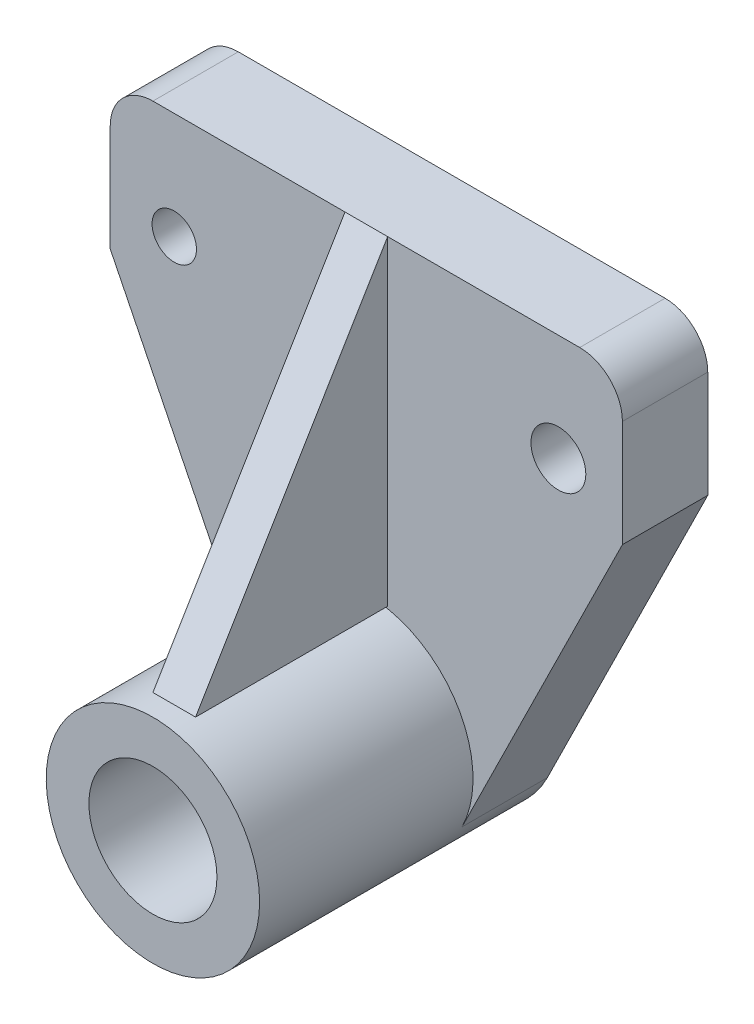
ISO-10303-21;
HEADER;
FILE_DESCRIPTION(('STEP AP214'),'2;1');
FILE_NAME('part.step','',(''),(''),'','','');
FILE_SCHEMA(('AUTOMOTIVE_DESIGN { 1 0 10303 214 1 1 1 1 }'));
ENDSEC;
DATA;
#1=APPLICATION_CONTEXT('core data for automotive mechanical design processes');
#2=APPLICATION_PROTOCOL_DEFINITION('international standard','automotive_design',2000,#1);
#3=PRODUCT_CONTEXT('',#1,'mechanical');
#4=PRODUCT('Part','Part','',(#3));
#5=PRODUCT_RELATED_PRODUCT_CATEGORY('part','',(#4));
#6=PRODUCT_DEFINITION_FORMATION('','',#4);
#7=PRODUCT_DEFINITION_CONTEXT('part definition',#1,'design');
#8=PRODUCT_DEFINITION('design','',#6,#7);
#9=PRODUCT_DEFINITION_SHAPE('','',#8);
#10=(LENGTH_UNIT() NAMED_UNIT(*) SI_UNIT(.MILLI.,.METRE.));
#11=(NAMED_UNIT(*) PLANE_ANGLE_UNIT() SI_UNIT($,.RADIAN.));
#12=(NAMED_UNIT(*) SI_UNIT($,.STERADIAN.) SOLID_ANGLE_UNIT());
#13=UNCERTAINTY_MEASURE_WITH_UNIT(LENGTH_MEASURE(1.E-05),#10,'distance_accuracy_value','');
#14=(GEOMETRIC_REPRESENTATION_CONTEXT(3) GLOBAL_UNCERTAINTY_ASSIGNED_CONTEXT((#13)) GLOBAL_UNIT_ASSIGNED_CONTEXT((#10,
#11,#12)) REPRESENTATION_CONTEXT('',''));
#15=CARTESIAN_POINT('',(0.,0.,0.));
#16=DIRECTION('',(0.,0.,1.));
#17=DIRECTION('',(1.,0.,0.));
#18=AXIS2_PLACEMENT_3D('',#15,#16,#17);
#19=CARTESIAN_POINT('',(5.,-3.23686117379484,65.));
#20=DIRECTION('',(0.,-0.514495755427526,-0.857492925712544));
#21=DIRECTION('',(0.,0.857492925712544,-0.514495755427526));
#22=AXIS2_PLACEMENT_3D('',#19,#20,#21);
#23=PLANE('',#22);
#24=DIRECTION('',(0.,-0.857492925712544,0.514495755427526));
#25=VECTOR('',#24,1.);
#26=CARTESIAN_POINT('',(-5.,-3.23686117379484,65.));
#27=LINE('',#26,#25);
#28=CARTESIAN_POINT('',(-5.,71.7631388262052,20.));
#29=VERTEX_POINT('',#28);
#30=CARTESIAN_POINT('',(-5.,-3.23686117379484,65.));
#31=VERTEX_POINT('',#30);
#32=EDGE_CURVE('E90',#29,#31,#27,.T.);
#33=ORIENTED_EDGE('',*,*,#32,.T.);
#34=DIRECTION('',(-1.,0.,0.));
#35=VECTOR('',#34,1.);
#36=CARTESIAN_POINT('',(5.,-3.23686117379484,65.));
#37=LINE('',#36,#35);
#38=CARTESIAN_POINT('',(5.,-3.23686117379484,65.));
#39=VERTEX_POINT('',#38);
#40=EDGE_CURVE('E12',#39,#31,#37,.T.);
#41=ORIENTED_EDGE('',*,*,#40,.F.);
#42=DIRECTION('',(0.,-0.857492925712544,0.514495755427526));
#43=VECTOR('',#42,1.);
#44=CARTESIAN_POINT('',(5.,-3.23686117379484,65.));
#45=LINE('',#44,#43);
#46=CARTESIAN_POINT('',(5.,71.7631388262052,20.));
#47=VERTEX_POINT('',#46);
#48=EDGE_CURVE('E83',#47,#39,#45,.T.);
#49=ORIENTED_EDGE('',*,*,#48,.F.);
#50=DIRECTION('',(-1.,0.,0.));
#51=VECTOR('',#50,1.);
#52=CARTESIAN_POINT('',(5.,71.7631388262052,20.));
#53=LINE('',#52,#51);
#54=EDGE_CURVE('E91',#47,#29,#53,.T.);
#55=ORIENTED_EDGE('',*,*,#54,.T.);
#56=EDGE_LOOP('',(#33,#41,#49,#55));
#57=FACE_BOUND('',#56,.T.);
#58=ADVANCED_FACE('F43',(#57),#23,.F.);
#59=CARTESIAN_POINT('',(5.,-3.23686117379484,20.));
#60=DIRECTION('',(0.,1.,0.));
#61=DIRECTION('',(0.,0.,1.));
#62=AXIS2_PLACEMENT_3D('',#59,#60,#61);
#63=PLANE('',#62);
#64=DIRECTION('',(0.,0.,-1.));
#65=VECTOR('',#64,1.);
#66=CARTESIAN_POINT('',(-5.,-3.23686117379484,20.));
#67=LINE('',#66,#65);
#68=CARTESIAN_POINT('',(-5.,-3.23686117379484,20.));
#69=VERTEX_POINT('',#68);
#70=EDGE_CURVE('E71',#31,#69,#67,.T.);
#71=ORIENTED_EDGE('',*,*,#70,.T.);
#72=DIRECTION('',(-1.,0.,0.));
#73=VECTOR('',#72,1.);
#74=CARTESIAN_POINT('',(5.,-3.23686117379484,20.));
#75=LINE('',#74,#73);
#76=CARTESIAN_POINT('',(5.,-3.23686117379484,20.));
#77=VERTEX_POINT('',#76);
#78=EDGE_CURVE('E51',#77,#69,#75,.T.);
#79=ORIENTED_EDGE('',*,*,#78,.F.);
#80=DIRECTION('',(0.,0.,-1.));
#81=VECTOR('',#80,1.);
#82=CARTESIAN_POINT('',(5.,-3.23686117379484,20.));
#83=LINE('',#82,#81);
#84=EDGE_CURVE('E79',#39,#77,#83,.T.);
#85=ORIENTED_EDGE('',*,*,#84,.F.);
#86=ORIENTED_EDGE('',*,*,#40,.T.);
#87=EDGE_LOOP('',(#71,#79,#85,#86));
#88=FACE_BOUND('',#87,.T.);
#89=ADVANCED_FACE('F80',(#88),#63,.F.);
#90=CARTESIAN_POINT('',(5.,71.7631388262052,20.));
#91=DIRECTION('',(0.,0.,1.));
#92=DIRECTION('',(1.,0.,0.));
#93=AXIS2_PLACEMENT_3D('',#90,#91,#92);
#94=PLANE('',#93);
#95=DIRECTION('',(0.,1.,0.));
#96=VECTOR('',#95,1.);
#97=CARTESIAN_POINT('',(-5.,71.7631388262052,20.));
#98=LINE('',#97,#96);
#99=EDGE_CURVE('E76',#69,#29,#98,.T.);
#100=ORIENTED_EDGE('',*,*,#99,.T.);
#101=ORIENTED_EDGE('',*,*,#54,.F.);
#102=DIRECTION('',(0.,1.,0.));
#103=VECTOR('',#102,1.);
#104=CARTESIAN_POINT('',(5.,71.7631388262052,20.));
#105=LINE('',#104,#103);
#106=EDGE_CURVE('E59',#77,#47,#105,.T.);
#107=ORIENTED_EDGE('',*,*,#106,.F.);
#108=ORIENTED_EDGE('',*,*,#78,.T.);
#109=EDGE_LOOP('',(#100,#101,#107,#108));
#110=FACE_BOUND('',#109,.T.);
#111=ADVANCED_FACE('F98',(#110),#94,.F.);
#112=CARTESIAN_POINT('',(5.,0.,0.));
#113=DIRECTION('',(1.,0.,0.));
#114=DIRECTION('',(0.,0.,-1.));
#115=AXIS2_PLACEMENT_3D('',#112,#113,#114);
#116=PLANE('',#115);
#117=ORIENTED_EDGE('',*,*,#48,.T.);
#118=ORIENTED_EDGE('',*,*,#84,.T.);
#119=ORIENTED_EDGE('',*,*,#106,.T.);
#120=EDGE_LOOP('',(#117,#118,#119));
#121=FACE_BOUND('',#120,.T.);
#122=ADVANCED_FACE('F86',(#121),#116,.T.);
#123=CARTESIAN_POINT('',(-5.,0.,0.));
#124=DIRECTION('',(1.,0.,0.));
#125=DIRECTION('',(0.,0.,-1.));
#126=AXIS2_PLACEMENT_3D('',#123,#124,#125);
#127=PLANE('',#126);
#128=ORIENTED_EDGE('',*,*,#32,.F.);
#129=ORIENTED_EDGE('',*,*,#99,.F.);
#130=ORIENTED_EDGE('',*,*,#70,.F.);
#131=EDGE_LOOP('',(#128,#129,#130));
#132=FACE_BOUND('',#131,.T.);
#133=ADVANCED_FACE('F99',(#132),#127,.F.);
#134=CLOSED_SHELL('',(#58,#89,#111,#122,#133));
#135=MANIFOLD_SOLID_BREP('B2',#134);
#136=CARTESIAN_POINT('',(0.,-28.2368611737948,20.));
#137=DIRECTION('',(0.,0.,1.));
#138=DIRECTION('',(1.,0.,0.));
#139=AXIS2_PLACEMENT_3D('',#136,#137,#138);
#140=PLANE('',#139);
#141=DIRECTION('',(-1.,0.,0.));
#142=VECTOR('',#141,1.);
#143=CARTESIAN_POINT('',(-60.,71.7631388262052,20.));
#144=LINE('',#143,#142);
#145=CARTESIAN_POINT('',(50.,71.7631388262052,20.));
#146=VERTEX_POINT('',#145);
#147=CARTESIAN_POINT('',(-50.,71.7631388262052,20.));
#148=VERTEX_POINT('',#147);
#149=EDGE_CURVE('E259',#146,#148,#144,.T.);
#150=ORIENTED_EDGE('',*,*,#149,.T.);
#151=CARTESIAN_POINT('',(-50.,61.7631388262052,20.));
#152=DIRECTION('',(0.,0.,1.));
#153=DIRECTION('',(1.,0.,0.));
#154=AXIS2_PLACEMENT_3D('',#151,#152,#153);
#155=CIRCLE('',#154,10.);
#156=CARTESIAN_POINT('',(-60.,61.7631388262052,20.));
#157=VERTEX_POINT('',#156);
#158=EDGE_CURVE('E149',#148,#157,#155,.T.);
#159=ORIENTED_EDGE('',*,*,#158,.T.);
#160=DIRECTION('',(0.,-1.,0.));
#161=VECTOR('',#160,1.);
#162=CARTESIAN_POINT('',(-60.,71.7631388262052,20.));
#163=LINE('',#162,#161);
#164=CARTESIAN_POINT('',(-60.,36.7631388262052,20.));
#165=VERTEX_POINT('',#164);
#166=EDGE_CURVE('E226',#157,#165,#163,.T.);
#167=ORIENTED_EDGE('',*,*,#166,.T.);
#168=DIRECTION('',(0.442960872146089,-0.896540944824929,0.));
#169=VECTOR('',#168,1.);
#170=CARTESIAN_POINT('',(-60.,36.7631388262052,20.));
#171=LINE('',#170,#169);
#172=CARTESIAN_POINT('',(-22.4135236206232,-39.310882977447,20.));
#173=VERTEX_POINT('',#172);
#174=EDGE_CURVE('E212',#165,#173,#171,.T.);
#175=ORIENTED_EDGE('',*,*,#174,.T.);
#176=CARTESIAN_POINT('',(0.,-28.2368611737948,20.));
#177=DIRECTION('',(0.,0.,1.));
#178=DIRECTION('',(1.,0.,0.));
#179=AXIS2_PLACEMENT_3D('',#176,#177,#178);
#180=CIRCLE('',#179,25.);
#181=CARTESIAN_POINT('',(22.4135236206232,-39.3108829774471,20.));
#182=VERTEX_POINT('',#181);
#183=EDGE_CURVE('E223',#182,#173,#180,.T.);
#184=ORIENTED_EDGE('',*,*,#183,.F.);
#185=DIRECTION('',(0.442960872146088,0.896540944824929,0.));
#186=VECTOR('',#185,1.);
#187=CARTESIAN_POINT('',(60.,36.7631388262052,20.));
#188=LINE('',#187,#186);
#189=CARTESIAN_POINT('',(60.,36.7631388262052,20.));
#190=VERTEX_POINT('',#189);
#191=EDGE_CURVE('E228',#182,#190,#188,.T.);
#192=ORIENTED_EDGE('',*,*,#191,.T.);
#193=DIRECTION('',(0.,1.,0.));
#194=VECTOR('',#193,1.);
#195=CARTESIAN_POINT('',(60.,71.7631388262052,20.));
#196=LINE('',#195,#194);
#197=CARTESIAN_POINT('',(60.,61.7631388262052,20.));
#198=VERTEX_POINT('',#197);
#199=EDGE_CURVE('E257',#190,#198,#196,.T.);
#200=ORIENTED_EDGE('',*,*,#199,.T.);
#201=CARTESIAN_POINT('',(50.,61.7631388262052,20.));
#202=DIRECTION('',(0.,0.,1.));
#203=DIRECTION('',(1.,0.,0.));
#204=AXIS2_PLACEMENT_3D('',#201,#202,#203);
#205=CIRCLE('',#204,10.);
#206=EDGE_CURVE('E284',#198,#146,#205,.T.);
#207=ORIENTED_EDGE('',*,*,#206,.T.);
#208=EDGE_LOOP('',(#150,#159,#167,#175,#184,#192,#200,#207));
#209=FACE_BOUND('',#208,.T.);
#210=CARTESIAN_POINT('',(-45.,46.7631388262052,20.));
#211=DIRECTION('',(0.,0.,1.));
#212=DIRECTION('',(1.,0.,0.));
#213=AXIS2_PLACEMENT_3D('',#210,#211,#212);
#214=CIRCLE('',#213,5.19877724187134);
#215=CARTESIAN_POINT('',(-39.8012227581286,46.7631388262052,20.));
#216=VERTEX_POINT('',#215);
#217=EDGE_CURVE('E251',#216,#216,#214,.T.);
#218=ORIENTED_EDGE('',*,*,#217,.F.);
#219=EDGE_LOOP('',(#218));
#220=FACE_BOUND('',#219,.T.);
#221=CARTESIAN_POINT('',(45.,46.7631388262052,20.));
#222=DIRECTION('',(0.,0.,1.));
#223=DIRECTION('',(1.,0.,0.));
#224=AXIS2_PLACEMENT_3D('',#221,#222,#223);
#225=CIRCLE('',#224,6.42929602346844);
#226=CARTESIAN_POINT('',(51.4292960234684,46.7631388262052,20.));
#227=VERTEX_POINT('',#226);
#228=EDGE_CURVE('E244',#227,#227,#225,.T.);
#229=ORIENTED_EDGE('',*,*,#228,.F.);
#230=EDGE_LOOP('',(#229));
#231=FACE_BOUND('',#230,.T.);
#232=ADVANCED_FACE('F141',(#209,#220,#231),#140,.T.);
#233=CARTESIAN_POINT('',(0.,-28.2368611737948,0.));
#234=DIRECTION('',(0.,0.,1.));
#235=DIRECTION('',(1.,0.,0.));
#236=AXIS2_PLACEMENT_3D('',#233,#234,#235);
#237=PLANE('',#236);
#238=CARTESIAN_POINT('',(0.,-28.2368611737948,0.));
#239=DIRECTION('',(0.,0.,1.));
#240=DIRECTION('',(1.,0.,0.));
#241=AXIS2_PLACEMENT_3D('',#238,#239,#240);
#242=CIRCLE('',#241,15.);
#243=CARTESIAN_POINT('',(15.,-28.2368611737948,0.));
#244=VERTEX_POINT('',#243);
#245=EDGE_CURVE('E341',#244,#244,#242,.T.);
#246=ORIENTED_EDGE('',*,*,#245,.T.);
#247=EDGE_LOOP('',(#246));
#248=FACE_BOUND('',#247,.T.);
#249=DIRECTION('',(0.,-1.,0.));
#250=VECTOR('',#249,1.);
#251=CARTESIAN_POINT('',(-60.,71.7631388262052,0.));
#252=LINE('',#251,#250);
#253=CARTESIAN_POINT('',(-60.,61.7631388262052,0.));
#254=VERTEX_POINT('',#253);
#255=CARTESIAN_POINT('',(-60.,36.7631388262052,0.));
#256=VERTEX_POINT('',#255);
#257=EDGE_CURVE('E268',#254,#256,#252,.T.);
#258=ORIENTED_EDGE('',*,*,#257,.F.);
#259=CARTESIAN_POINT('',(-50.,61.7631388262052,0.));
#260=DIRECTION('',(0.,0.,1.));
#261=DIRECTION('',(1.,0.,0.));
#262=AXIS2_PLACEMENT_3D('',#259,#260,#261);
#263=CIRCLE('',#262,10.);
#264=CARTESIAN_POINT('',(-50.,71.7631388262052,0.));
#265=VERTEX_POINT('',#264);
#266=EDGE_CURVE('E278',#254,#265,#263,.F.);
#267=ORIENTED_EDGE('',*,*,#266,.T.);
#268=DIRECTION('',(-1.,0.,0.));
#269=VECTOR('',#268,1.);
#270=CARTESIAN_POINT('',(-60.,71.7631388262052,0.));
#271=LINE('',#270,#269);
#272=CARTESIAN_POINT('',(50.,71.7631388262052,0.));
#273=VERTEX_POINT('',#272);
#274=EDGE_CURVE('E266',#273,#265,#271,.T.);
#275=ORIENTED_EDGE('',*,*,#274,.F.);
#276=CARTESIAN_POINT('',(50.,61.7631388262052,0.));
#277=DIRECTION('',(0.,0.,1.));
#278=DIRECTION('',(1.,0.,0.));
#279=AXIS2_PLACEMENT_3D('',#276,#277,#278);
#280=CIRCLE('',#279,10.);
#281=CARTESIAN_POINT('',(60.,61.7631388262052,0.));
#282=VERTEX_POINT('',#281);
#283=EDGE_CURVE('E237',#273,#282,#280,.F.);
#284=ORIENTED_EDGE('',*,*,#283,.T.);
#285=DIRECTION('',(0.,1.,0.));
#286=VECTOR('',#285,1.);
#287=CARTESIAN_POINT('',(60.,71.7631388262052,0.));
#288=LINE('',#287,#286);
#289=CARTESIAN_POINT('',(60.,36.7631388262052,0.));
#290=VERTEX_POINT('',#289);
#291=EDGE_CURVE('E254',#290,#282,#288,.T.);
#292=ORIENTED_EDGE('',*,*,#291,.F.);
#293=DIRECTION('',(0.442960872146088,0.896540944824929,0.));
#294=VECTOR('',#293,1.);
#295=CARTESIAN_POINT('',(60.,36.7631388262052,0.));
#296=LINE('',#295,#294);
#297=CARTESIAN_POINT('',(22.4135236206232,-39.3108829774471,0.));
#298=VERTEX_POINT('',#297);
#299=EDGE_CURVE('E260',#298,#290,#296,.T.);
#300=ORIENTED_EDGE('',*,*,#299,.F.);
#301=CARTESIAN_POINT('',(0.,-28.2368611737948,0.));
#302=DIRECTION('',(0.,0.,1.));
#303=DIRECTION('',(1.,0.,0.));
#304=AXIS2_PLACEMENT_3D('',#301,#302,#303);
#305=CIRCLE('',#304,25.);
#306=CARTESIAN_POINT('',(-22.4135236206232,-39.310882977447,0.));
#307=VERTEX_POINT('',#306);
#308=EDGE_CURVE('E271',#307,#298,#305,.T.);
#309=ORIENTED_EDGE('',*,*,#308,.F.);
#310=DIRECTION('',(0.442960872146089,-0.896540944824929,0.));
#311=VECTOR('',#310,1.);
#312=CARTESIAN_POINT('',(-60.,36.7631388262052,0.));
#313=LINE('',#312,#311);
#314=EDGE_CURVE('E214',#256,#307,#313,.T.);
#315=ORIENTED_EDGE('',*,*,#314,.F.);
#316=EDGE_LOOP('',(#258,#267,#275,#284,#292,#300,#309,#315));
#317=FACE_BOUND('',#316,.T.);
#318=CARTESIAN_POINT('',(-45.,46.7631388262052,0.));
#319=DIRECTION('',(0.,0.,1.));
#320=DIRECTION('',(1.,0.,0.));
#321=AXIS2_PLACEMENT_3D('',#318,#319,#320);
#322=CIRCLE('',#321,5.19877724187134);
#323=CARTESIAN_POINT('',(-39.8012227581286,46.7631388262052,0.));
#324=VERTEX_POINT('',#323);
#325=EDGE_CURVE('E247',#324,#324,#322,.T.);
#326=ORIENTED_EDGE('',*,*,#325,.T.);
#327=EDGE_LOOP('',(#326));
#328=FACE_BOUND('',#327,.T.);
#329=CARTESIAN_POINT('',(45.,46.7631388262052,0.));
#330=DIRECTION('',(0.,0.,1.));
#331=DIRECTION('',(1.,0.,0.));
#332=AXIS2_PLACEMENT_3D('',#329,#330,#331);
#333=CIRCLE('',#332,6.42929602346844);
#334=CARTESIAN_POINT('',(51.4292960234684,46.7631388262052,0.));
#335=VERTEX_POINT('',#334);
#336=EDGE_CURVE('E248',#335,#335,#333,.T.);
#337=ORIENTED_EDGE('',*,*,#336,.T.);
#338=EDGE_LOOP('',(#337));
#339=FACE_BOUND('',#338,.T.);
#340=ADVANCED_FACE('F294',(#248,#317,#328,#339),#237,.F.);
#341=CARTESIAN_POINT('',(60.,71.7631388262052,20.));
#342=DIRECTION('',(-1.,0.,0.));
#343=DIRECTION('',(0.,-1.,0.));
#344=AXIS2_PLACEMENT_3D('',#341,#342,#343);
#345=PLANE('',#344);
#346=ORIENTED_EDGE('',*,*,#291,.T.);
#347=DIRECTION('',(0.,0.,-1.));
#348=VECTOR('',#347,1.);
#349=CARTESIAN_POINT('',(60.,61.7631388262052,20.));
#350=LINE('',#349,#348);
#351=EDGE_CURVE('E41',#282,#198,#350,.F.);
#352=ORIENTED_EDGE('',*,*,#351,.T.);
#353=ORIENTED_EDGE('',*,*,#199,.F.);
#354=DIRECTION('',(0.,0.,-1.));
#355=VECTOR('',#354,1.);
#356=CARTESIAN_POINT('',(60.,36.7631388262052,20.));
#357=LINE('',#356,#355);
#358=EDGE_CURVE('E264',#190,#290,#357,.T.);
#359=ORIENTED_EDGE('',*,*,#358,.T.);
#360=EDGE_LOOP('',(#346,#352,#353,#359));
#361=FACE_BOUND('',#360,.T.);
#362=ADVANCED_FACE('F302',(#361),#345,.F.);
#363=CARTESIAN_POINT('',(-60.,71.7631388262052,20.));
#364=DIRECTION('',(0.,-1.,0.));
#365=DIRECTION('',(0.,0.,-1.));
#366=AXIS2_PLACEMENT_3D('',#363,#364,#365);
#367=PLANE('',#366);
#368=ORIENTED_EDGE('',*,*,#274,.T.);
#369=DIRECTION('',(0.,0.,-1.));
#370=VECTOR('',#369,1.);
#371=CARTESIAN_POINT('',(-50.,71.7631388262052,20.));
#372=LINE('',#371,#370);
#373=EDGE_CURVE('E162',#265,#148,#372,.F.);
#374=ORIENTED_EDGE('',*,*,#373,.T.);
#375=ORIENTED_EDGE('',*,*,#149,.F.);
#376=DIRECTION('',(0.,0.,-1.));
#377=VECTOR('',#376,1.);
#378=CARTESIAN_POINT('',(50.,71.7631388262052,20.));
#379=LINE('',#378,#377);
#380=EDGE_CURVE('E280',#146,#273,#379,.T.);
#381=ORIENTED_EDGE('',*,*,#380,.T.);
#382=EDGE_LOOP('',(#368,#374,#375,#381));
#383=FACE_BOUND('',#382,.T.);
#384=ADVANCED_FACE('F296',(#383),#367,.F.);
#385=CARTESIAN_POINT('',(-60.,71.7631388262052,20.));
#386=DIRECTION('',(1.,0.,0.));
#387=DIRECTION('',(0.,1.,0.));
#388=AXIS2_PLACEMENT_3D('',#385,#386,#387);
#389=PLANE('',#388);
#390=ORIENTED_EDGE('',*,*,#166,.F.);
#391=DIRECTION('',(0.,0.,-1.));
#392=VECTOR('',#391,1.);
#393=CARTESIAN_POINT('',(-60.,61.7631388262052,20.));
#394=LINE('',#393,#392);
#395=EDGE_CURVE('E234',#157,#254,#394,.T.);
#396=ORIENTED_EDGE('',*,*,#395,.T.);
#397=ORIENTED_EDGE('',*,*,#257,.T.);
#398=DIRECTION('',(0.,0.,-1.));
#399=VECTOR('',#398,1.);
#400=CARTESIAN_POINT('',(-60.,36.7631388262052,20.));
#401=LINE('',#400,#399);
#402=EDGE_CURVE('E218',#165,#256,#401,.T.);
#403=ORIENTED_EDGE('',*,*,#402,.F.);
#404=EDGE_LOOP('',(#390,#396,#397,#403));
#405=FACE_BOUND('',#404,.T.);
#406=ADVANCED_FACE('F289',(#405),#389,.F.);
#407=CARTESIAN_POINT('',(-60.,36.7631388262052,20.));
#408=DIRECTION('',(0.896540944824929,0.442960872146089,0.));
#409=DIRECTION('',(-0.442960872146089,0.896540944824929,0.));
#410=AXIS2_PLACEMENT_3D('',#407,#408,#409);
#411=PLANE('',#410);
#412=ORIENTED_EDGE('',*,*,#314,.T.);
#413=DIRECTION('',(0.,0.,-1.));
#414=VECTOR('',#413,1.);
#415=CARTESIAN_POINT('',(-22.4135236206232,-39.310882977447,20.));
#416=LINE('',#415,#414);
#417=EDGE_CURVE('E208',#173,#307,#416,.T.);
#418=ORIENTED_EDGE('',*,*,#417,.F.);
#419=ORIENTED_EDGE('',*,*,#174,.F.);
#420=ORIENTED_EDGE('',*,*,#402,.T.);
#421=EDGE_LOOP('',(#412,#418,#419,#420));
#422=FACE_BOUND('',#421,.T.);
#423=ADVANCED_FACE('F210',(#422),#411,.F.);
#424=CARTESIAN_POINT('',(0.,-28.2368611737948,20.));
#425=DIRECTION('',(0.,0.,-1.));
#426=DIRECTION('',(-1.,0.,0.));
#427=AXIS2_PLACEMENT_3D('',#424,#425,#426);
#428=CYLINDRICAL_SURFACE('',#427,25.);
#429=ORIENTED_EDGE('',*,*,#308,.T.);
#430=DIRECTION('',(0.,0.,-1.));
#431=VECTOR('',#430,1.);
#432=CARTESIAN_POINT('',(22.4135236206232,-39.3108829774471,20.));
#433=LINE('',#432,#431);
#434=EDGE_CURVE('E219',#182,#298,#433,.T.);
#435=ORIENTED_EDGE('',*,*,#434,.F.);
#436=ORIENTED_EDGE('',*,*,#183,.T.);
#437=ORIENTED_EDGE('',*,*,#417,.T.);
#438=EDGE_LOOP('',(#429,#435,#436,#437));
#439=FACE_BOUND('',#438,.T.);
#440=CARTESIAN_POINT('',(0.,-28.2368611737948,70.));
#441=DIRECTION('',(0.,0.,1.));
#442=DIRECTION('',(1.,0.,0.));
#443=AXIS2_PLACEMENT_3D('',#440,#441,#442);
#444=CIRCLE('',#443,25.);
#445=CARTESIAN_POINT('',(25.,-28.2368611737948,70.));
#446=VERTEX_POINT('',#445);
#447=EDGE_CURVE('E242',#446,#446,#444,.T.);
#448=ORIENTED_EDGE('',*,*,#447,.F.);
#449=EDGE_LOOP('',(#448));
#450=FACE_BOUND('',#449,.T.);
#451=ADVANCED_FACE('F230',(#439,#450),#428,.T.);
#452=CARTESIAN_POINT('',(60.,36.7631388262052,20.));
#453=DIRECTION('',(-0.896540944824929,0.442960872146088,0.));
#454=DIRECTION('',(-0.442960872146088,-0.896540944824929,0.));
#455=AXIS2_PLACEMENT_3D('',#452,#453,#454);
#456=PLANE('',#455);
#457=ORIENTED_EDGE('',*,*,#299,.T.);
#458=ORIENTED_EDGE('',*,*,#358,.F.);
#459=ORIENTED_EDGE('',*,*,#191,.F.);
#460=ORIENTED_EDGE('',*,*,#434,.T.);
#461=EDGE_LOOP('',(#457,#458,#459,#460));
#462=FACE_BOUND('',#461,.T.);
#463=ADVANCED_FACE('F305',(#462),#456,.F.);
#464=CARTESIAN_POINT('',(-45.,46.7631388262052,20.));
#465=DIRECTION('',(0.,0.,-1.));
#466=DIRECTION('',(-1.,0.,0.));
#467=AXIS2_PLACEMENT_3D('',#464,#465,#466);
#468=CYLINDRICAL_SURFACE('',#467,5.19877724187134);
#469=ORIENTED_EDGE('',*,*,#217,.T.);
#470=EDGE_LOOP('',(#469));
#471=FACE_BOUND('',#470,.T.);
#472=ORIENTED_EDGE('',*,*,#325,.F.);
#473=EDGE_LOOP('',(#472));
#474=FACE_BOUND('',#473,.T.);
#475=ADVANCED_FACE('F307',(#471,#474),#468,.F.);
#476=CARTESIAN_POINT('',(45.,46.7631388262052,20.));
#477=DIRECTION('',(0.,0.,-1.));
#478=DIRECTION('',(-1.,0.,0.));
#479=AXIS2_PLACEMENT_3D('',#476,#477,#478);
#480=CYLINDRICAL_SURFACE('',#479,6.42929602346844);
#481=ORIENTED_EDGE('',*,*,#228,.T.);
#482=EDGE_LOOP('',(#481));
#483=FACE_BOUND('',#482,.T.);
#484=ORIENTED_EDGE('',*,*,#336,.F.);
#485=EDGE_LOOP('',(#484));
#486=FACE_BOUND('',#485,.T.);
#487=ADVANCED_FACE('F313',(#483,#486),#480,.F.);
#488=CARTESIAN_POINT('',(0.,-28.2368611737948,70.));
#489=DIRECTION('',(0.,0.,1.));
#490=DIRECTION('',(1.,0.,0.));
#491=AXIS2_PLACEMENT_3D('',#488,#489,#490);
#492=PLANE('',#491);
#493=CARTESIAN_POINT('',(0.,-28.2368611737948,70.));
#494=DIRECTION('',(0.,0.,1.));
#495=DIRECTION('',(1.,0.,0.));
#496=AXIS2_PLACEMENT_3D('',#493,#494,#495);
#497=CIRCLE('',#496,15.);
#498=CARTESIAN_POINT('',(15.,-28.2368611737948,70.));
#499=VERTEX_POINT('',#498);
#500=EDGE_CURVE('E344',#499,#499,#497,.T.);
#501=ORIENTED_EDGE('',*,*,#500,.F.);
#502=EDGE_LOOP('',(#501));
#503=FACE_BOUND('',#502,.T.);
#504=ORIENTED_EDGE('',*,*,#447,.T.);
#505=EDGE_LOOP('',(#504));
#506=FACE_BOUND('',#505,.T.);
#507=ADVANCED_FACE('F327',(#503,#506),#492,.T.);
#508=CARTESIAN_POINT('',(0.,-28.2368611737948,0.));
#509=DIRECTION('',(0.,0.,1.));
#510=DIRECTION('',(1.,0.,0.));
#511=AXIS2_PLACEMENT_3D('',#508,#509,#510);
#512=CYLINDRICAL_SURFACE('',#511,15.);
#513=ORIENTED_EDGE('',*,*,#245,.F.);
#514=EDGE_LOOP('',(#513));
#515=FACE_BOUND('',#514,.T.);
#516=ORIENTED_EDGE('',*,*,#500,.T.);
#517=EDGE_LOOP('',(#516));
#518=FACE_BOUND('',#517,.T.);
#519=ADVANCED_FACE('F331',(#515,#518),#512,.F.);
#520=CARTESIAN_POINT('',(-50.,61.7631388262052,20.));
#521=DIRECTION('',(0.,0.,-1.));
#522=DIRECTION('',(-1.,0.,0.));
#523=AXIS2_PLACEMENT_3D('',#520,#521,#522);
#524=CYLINDRICAL_SURFACE('',#523,10.);
#525=ORIENTED_EDGE('',*,*,#158,.F.);
#526=ORIENTED_EDGE('',*,*,#373,.F.);
#527=ORIENTED_EDGE('',*,*,#266,.F.);
#528=ORIENTED_EDGE('',*,*,#395,.F.);
#529=EDGE_LOOP('',(#525,#526,#527,#528));
#530=FACE_BOUND('',#529,.T.);
#531=ADVANCED_FACE('F291',(#530),#524,.T.);
#532=CARTESIAN_POINT('',(50.,61.7631388262052,20.));
#533=DIRECTION('',(0.,0.,-1.));
#534=DIRECTION('',(-1.,0.,0.));
#535=AXIS2_PLACEMENT_3D('',#532,#533,#534);
#536=CYLINDRICAL_SURFACE('',#535,10.);
#537=ORIENTED_EDGE('',*,*,#206,.F.);
#538=ORIENTED_EDGE('',*,*,#351,.F.);
#539=ORIENTED_EDGE('',*,*,#283,.F.);
#540=ORIENTED_EDGE('',*,*,#380,.F.);
#541=EDGE_LOOP('',(#537,#538,#539,#540));
#542=FACE_BOUND('',#541,.T.);
#543=ADVANCED_FACE('F143',(#542),#536,.T.);
#544=CLOSED_SHELL('',(#232,#340,#362,#384,#406,#423,#451,#463,#475,#487,#507,#519,#531,#543));
#545=MANIFOLD_SOLID_BREP('B6',#544);
#546=ADVANCED_BREP_SHAPE_REPRESENTATION('',(#18,#135,#545),#14);
#547=SHAPE_DEFINITION_REPRESENTATION(#9,#546);
ENDSEC;
END-ISO-10303-21;
